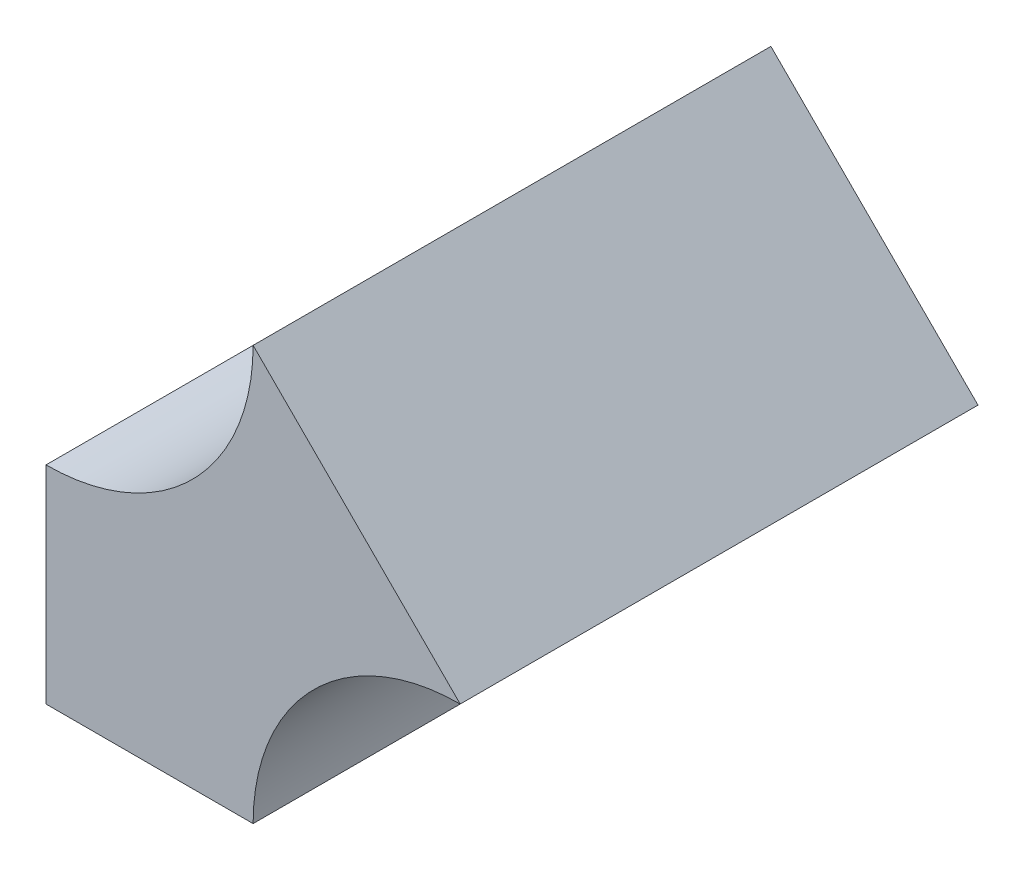
ISO-10303-21;
HEADER;
FILE_DESCRIPTION(('STEP AP214'),'2;1');
FILE_NAME('part.step','',(''),(''),'','','');
FILE_SCHEMA(('AUTOMOTIVE_DESIGN { 1 0 10303 214 1 1 1 1 }'));
ENDSEC;
DATA;
#1=APPLICATION_CONTEXT('core data for automotive mechanical design processes');
#2=APPLICATION_PROTOCOL_DEFINITION('international standard','automotive_design',2000,#1);
#3=PRODUCT_CONTEXT('',#1,'mechanical');
#4=PRODUCT('Part','Part','',(#3));
#5=PRODUCT_RELATED_PRODUCT_CATEGORY('part','',(#4));
#6=PRODUCT_DEFINITION_FORMATION('','',#4);
#7=PRODUCT_DEFINITION_CONTEXT('part definition',#1,'design');
#8=PRODUCT_DEFINITION('design','',#6,#7);
#9=PRODUCT_DEFINITION_SHAPE('','',#8);
#10=(LENGTH_UNIT() NAMED_UNIT(*) SI_UNIT(.MILLI.,.METRE.));
#11=(NAMED_UNIT(*) PLANE_ANGLE_UNIT() SI_UNIT($,.RADIAN.));
#12=(NAMED_UNIT(*) SI_UNIT($,.STERADIAN.) SOLID_ANGLE_UNIT());
#13=UNCERTAINTY_MEASURE_WITH_UNIT(LENGTH_MEASURE(1.E-05),#10,'distance_accuracy_value','');
#14=(GEOMETRIC_REPRESENTATION_CONTEXT(3) GLOBAL_UNCERTAINTY_ASSIGNED_CONTEXT((#13)) GLOBAL_UNIT_ASSIGNED_CONTEXT((#10,
#11,#12)) REPRESENTATION_CONTEXT('',''));
#15=CARTESIAN_POINT('',(0.,0.,0.));
#16=DIRECTION('',(0.,0.,1.));
#17=DIRECTION('',(1.,0.,0.));
#18=AXIS2_PLACEMENT_3D('',#15,#16,#17);
#19=CARTESIAN_POINT('',(-10.,20.,25.));
#20=DIRECTION('',(0.,0.,-1.));
#21=DIRECTION('',(-1.,0.,0.));
#22=AXIS2_PLACEMENT_3D('',#19,#20,#21);
#23=CYLINDRICAL_SURFACE('',#22,10.);
#24=CARTESIAN_POINT('',(-10.,20.,0.));
#25=DIRECTION('',(0.,0.,-1.));
#26=DIRECTION('',(1.,0.,0.));
#27=AXIS2_PLACEMENT_3D('',#24,#25,#26);
#28=CIRCLE('',#27,10.);
#29=CARTESIAN_POINT('',(0.,20.,0.));
#30=VERTEX_POINT('',#29);
#31=CARTESIAN_POINT('',(-10.,10.,0.));
#32=VERTEX_POINT('',#31);
#33=EDGE_CURVE('E107',#30,#32,#28,.T.);
#34=ORIENTED_EDGE('',*,*,#33,.T.);
#35=DIRECTION('',(0.,0.,-1.));
#36=VECTOR('',#35,1.);
#37=CARTESIAN_POINT('',(-10.,10.,25.));
#38=LINE('',#37,#36);
#39=CARTESIAN_POINT('',(-10.,10.,25.));
#40=VERTEX_POINT('',#39);
#41=EDGE_CURVE('E11',#40,#32,#38,.T.);
#42=ORIENTED_EDGE('',*,*,#41,.F.);
#43=CARTESIAN_POINT('',(-10.,20.,25.));
#44=DIRECTION('',(0.,0.,-1.));
#45=DIRECTION('',(1.,0.,0.));
#46=AXIS2_PLACEMENT_3D('',#43,#44,#45);
#47=CIRCLE('',#46,10.);
#48=CARTESIAN_POINT('',(0.,20.,25.));
#49=VERTEX_POINT('',#48);
#50=EDGE_CURVE('E115',#49,#40,#47,.T.);
#51=ORIENTED_EDGE('',*,*,#50,.F.);
#52=DIRECTION('',(0.,0.,-1.));
#53=VECTOR('',#52,1.);
#54=CARTESIAN_POINT('',(0.,20.,25.));
#55=LINE('',#54,#53);
#56=EDGE_CURVE('E103',#49,#30,#55,.T.);
#57=ORIENTED_EDGE('',*,*,#56,.T.);
#58=EDGE_LOOP('',(#34,#42,#51,#57));
#59=FACE_BOUND('',#58,.T.);
#60=ADVANCED_FACE('F33',(#59),#23,.F.);
#61=CARTESIAN_POINT('',(-10.,10.,25.));
#62=DIRECTION('',(1.,0.,0.));
#63=DIRECTION('',(0.,1.,0.));
#64=AXIS2_PLACEMENT_3D('',#61,#62,#63);
#65=PLANE('',#64);
#66=DIRECTION('',(0.,-1.,0.));
#67=VECTOR('',#66,1.);
#68=CARTESIAN_POINT('',(-10.,10.,0.));
#69=LINE('',#68,#67);
#70=CARTESIAN_POINT('',(-10.,0.,0.));
#71=VERTEX_POINT('',#70);
#72=EDGE_CURVE('E110',#32,#71,#69,.T.);
#73=ORIENTED_EDGE('',*,*,#72,.T.);
#74=DIRECTION('',(0.,0.,-1.));
#75=VECTOR('',#74,1.);
#76=CARTESIAN_POINT('',(-10.,0.,25.));
#77=LINE('',#76,#75);
#78=CARTESIAN_POINT('',(-10.,0.,25.));
#79=VERTEX_POINT('',#78);
#80=EDGE_CURVE('E41',#79,#71,#77,.T.);
#81=ORIENTED_EDGE('',*,*,#80,.F.);
#82=DIRECTION('',(0.,-1.,0.));
#83=VECTOR('',#82,1.);
#84=CARTESIAN_POINT('',(-10.,10.,25.));
#85=LINE('',#84,#83);
#86=EDGE_CURVE('E83',#40,#79,#85,.T.);
#87=ORIENTED_EDGE('',*,*,#86,.F.);
#88=ORIENTED_EDGE('',*,*,#41,.T.);
#89=EDGE_LOOP('',(#73,#81,#87,#88));
#90=FACE_BOUND('',#89,.T.);
#91=ADVANCED_FACE('F134',(#90),#65,.F.);
#92=CARTESIAN_POINT('',(-10.,0.,25.));
#93=DIRECTION('',(0.,1.,0.));
#94=DIRECTION('',(0.,0.,1.));
#95=AXIS2_PLACEMENT_3D('',#92,#93,#94);
#96=PLANE('',#95);
#97=DIRECTION('',(1.,0.,0.));
#98=VECTOR('',#97,1.);
#99=CARTESIAN_POINT('',(-10.,0.,0.));
#100=LINE('',#99,#98);
#101=CARTESIAN_POINT('',(0.,0.,0.));
#102=VERTEX_POINT('',#101);
#103=EDGE_CURVE('E98',#71,#102,#100,.T.);
#104=ORIENTED_EDGE('',*,*,#103,.T.);
#105=DIRECTION('',(0.,0.,-1.));
#106=VECTOR('',#105,1.);
#107=CARTESIAN_POINT('',(0.,0.,25.));
#108=LINE('',#107,#106);
#109=CARTESIAN_POINT('',(0.,0.,25.));
#110=VERTEX_POINT('',#109);
#111=EDGE_CURVE('E95',#110,#102,#108,.T.);
#112=ORIENTED_EDGE('',*,*,#111,.F.);
#113=DIRECTION('',(1.,0.,0.));
#114=VECTOR('',#113,1.);
#115=CARTESIAN_POINT('',(-10.,0.,25.));
#116=LINE('',#115,#114);
#117=EDGE_CURVE('E87',#79,#110,#116,.T.);
#118=ORIENTED_EDGE('',*,*,#117,.F.);
#119=ORIENTED_EDGE('',*,*,#80,.T.);
#120=EDGE_LOOP('',(#104,#112,#118,#119));
#121=FACE_BOUND('',#120,.T.);
#122=ADVANCED_FACE('F96',(#121),#96,.F.);
#123=CARTESIAN_POINT('',(10.,0.,25.));
#124=DIRECTION('',(0.,0.,-1.));
#125=DIRECTION('',(-1.,0.,0.));
#126=AXIS2_PLACEMENT_3D('',#123,#124,#125);
#127=CYLINDRICAL_SURFACE('',#126,10.);
#128=CARTESIAN_POINT('',(10.,0.,0.));
#129=DIRECTION('',(0.,0.,-1.));
#130=DIRECTION('',(-1.,0.,0.));
#131=AXIS2_PLACEMENT_3D('',#128,#129,#130);
#132=CIRCLE('',#131,10.);
#133=CARTESIAN_POINT('',(9.99999999999999,10.,0.));
#134=VERTEX_POINT('',#133);
#135=EDGE_CURVE('E69',#102,#134,#132,.T.);
#136=ORIENTED_EDGE('',*,*,#135,.T.);
#137=DIRECTION('',(0.,0.,-1.));
#138=VECTOR('',#137,1.);
#139=CARTESIAN_POINT('',(9.99999999999999,10.,25.));
#140=LINE('',#139,#138);
#141=CARTESIAN_POINT('',(9.99999999999999,10.,25.));
#142=VERTEX_POINT('',#141);
#143=EDGE_CURVE('E99',#142,#134,#140,.T.);
#144=ORIENTED_EDGE('',*,*,#143,.F.);
#145=CARTESIAN_POINT('',(10.,0.,25.));
#146=DIRECTION('',(0.,0.,-1.));
#147=DIRECTION('',(-1.,0.,0.));
#148=AXIS2_PLACEMENT_3D('',#145,#146,#147);
#149=CIRCLE('',#148,10.);
#150=EDGE_CURVE('E91',#110,#142,#149,.T.);
#151=ORIENTED_EDGE('',*,*,#150,.F.);
#152=ORIENTED_EDGE('',*,*,#111,.T.);
#153=EDGE_LOOP('',(#136,#144,#151,#152));
#154=FACE_BOUND('',#153,.T.);
#155=ADVANCED_FACE('F101',(#154),#127,.F.);
#156=CARTESIAN_POINT('',(9.99999999999999,10.,25.));
#157=DIRECTION('',(-0.707106781186548,-0.707106781186548,0.));
#158=DIRECTION('',(0.707106781186548,-0.707106781186548,0.));
#159=AXIS2_PLACEMENT_3D('',#156,#157,#158);
#160=PLANE('',#159);
#161=DIRECTION('',(-0.707106781186548,0.707106781186548,0.));
#162=VECTOR('',#161,1.);
#163=CARTESIAN_POINT('',(9.99999999999999,10.,0.));
#164=LINE('',#163,#162);
#165=EDGE_CURVE('E75',#134,#30,#164,.T.);
#166=ORIENTED_EDGE('',*,*,#165,.T.);
#167=ORIENTED_EDGE('',*,*,#56,.F.);
#168=DIRECTION('',(-0.707106781186548,0.707106781186548,0.));
#169=VECTOR('',#168,1.);
#170=CARTESIAN_POINT('',(9.99999999999999,10.,25.));
#171=LINE('',#170,#169);
#172=EDGE_CURVE('E49',#142,#49,#171,.T.);
#173=ORIENTED_EDGE('',*,*,#172,.F.);
#174=ORIENTED_EDGE('',*,*,#143,.T.);
#175=EDGE_LOOP('',(#166,#167,#173,#174));
#176=FACE_BOUND('',#175,.T.);
#177=ADVANCED_FACE('F123',(#176),#160,.F.);
#178=CARTESIAN_POINT('',(-10.,20.,25.));
#179=DIRECTION('',(0.,0.,1.));
#180=DIRECTION('',(1.,0.,0.));
#181=AXIS2_PLACEMENT_3D('',#178,#179,#180);
#182=PLANE('',#181);
#183=ORIENTED_EDGE('',*,*,#50,.T.);
#184=ORIENTED_EDGE('',*,*,#86,.T.);
#185=ORIENTED_EDGE('',*,*,#117,.T.);
#186=ORIENTED_EDGE('',*,*,#150,.T.);
#187=ORIENTED_EDGE('',*,*,#172,.T.);
#188=EDGE_LOOP('',(#183,#184,#185,#186,#187));
#189=FACE_BOUND('',#188,.T.);
#190=ADVANCED_FACE('F89',(#189),#182,.T.);
#191=CARTESIAN_POINT('',(-10.,20.,0.));
#192=DIRECTION('',(0.,0.,1.));
#193=DIRECTION('',(1.,0.,0.));
#194=AXIS2_PLACEMENT_3D('',#191,#192,#193);
#195=PLANE('',#194);
#196=ORIENTED_EDGE('',*,*,#33,.F.);
#197=ORIENTED_EDGE('',*,*,#165,.F.);
#198=ORIENTED_EDGE('',*,*,#135,.F.);
#199=ORIENTED_EDGE('',*,*,#103,.F.);
#200=ORIENTED_EDGE('',*,*,#72,.F.);
#201=EDGE_LOOP('',(#196,#197,#198,#199,#200));
#202=FACE_BOUND('',#201,.T.);
#203=ADVANCED_FACE('F119',(#202),#195,.F.);
#204=CLOSED_SHELL('',(#60,#91,#122,#155,#177,#190,#203));
#205=MANIFOLD_SOLID_BREP('B2',#204);
#206=ADVANCED_BREP_SHAPE_REPRESENTATION('',(#18,#205),#14);
#207=SHAPE_DEFINITION_REPRESENTATION(#9,#206);
ENDSEC;
END-ISO-10303-21;
